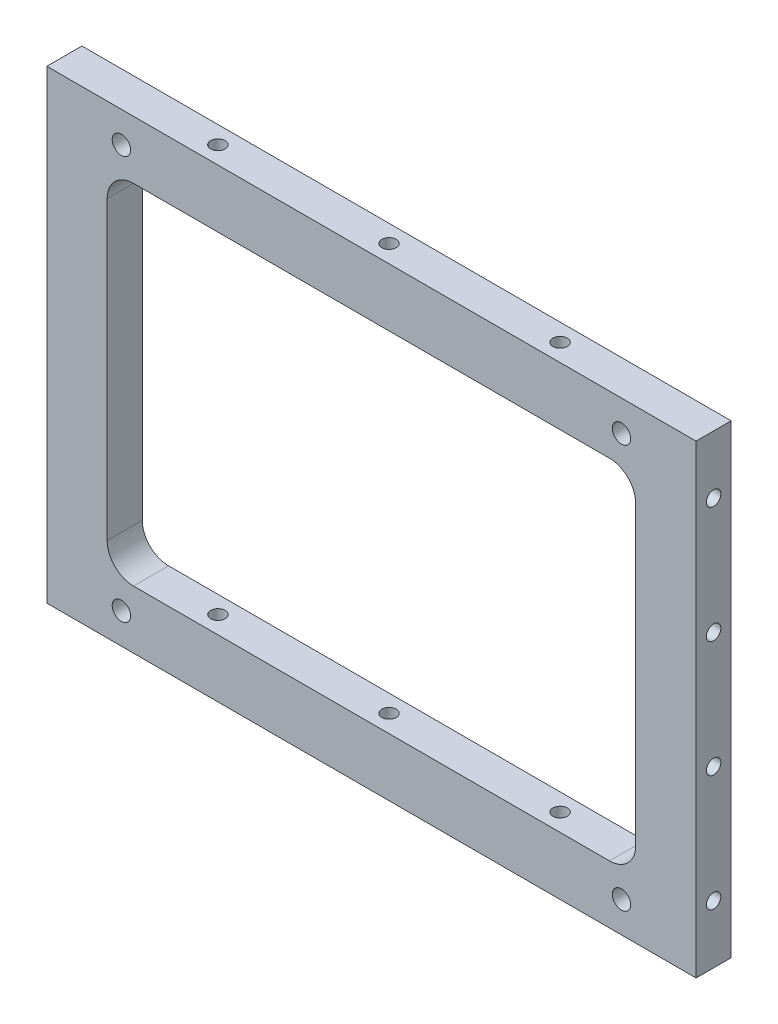
ISO-10303-21;
HEADER;
FILE_DESCRIPTION(('STEP AP214'),'2;1');
FILE_NAME('part.step','',(''),(''),'','','');
FILE_SCHEMA(('AUTOMOTIVE_DESIGN { 1 0 10303 214 1 1 1 1 }'));
ENDSEC;
DATA;
#1=APPLICATION_CONTEXT('core data for automotive mechanical design processes');
#2=APPLICATION_PROTOCOL_DEFINITION('international standard','automotive_design',2000,#1);
#3=PRODUCT_CONTEXT('',#1,'mechanical');
#4=PRODUCT('Part','Part','',(#3));
#5=PRODUCT_RELATED_PRODUCT_CATEGORY('part','',(#4));
#6=PRODUCT_DEFINITION_FORMATION('','',#4);
#7=PRODUCT_DEFINITION_CONTEXT('part definition',#1,'design');
#8=PRODUCT_DEFINITION('design','',#6,#7);
#9=PRODUCT_DEFINITION_SHAPE('','',#8);
#10=(LENGTH_UNIT() NAMED_UNIT(*) SI_UNIT(.MILLI.,.METRE.));
#11=(NAMED_UNIT(*) PLANE_ANGLE_UNIT() SI_UNIT($,.RADIAN.));
#12=(NAMED_UNIT(*) SI_UNIT($,.STERADIAN.) SOLID_ANGLE_UNIT());
#13=UNCERTAINTY_MEASURE_WITH_UNIT(LENGTH_MEASURE(1.E-05),#10,'distance_accuracy_value','');
#14=(GEOMETRIC_REPRESENTATION_CONTEXT(3) GLOBAL_UNCERTAINTY_ASSIGNED_CONTEXT((#13)) GLOBAL_UNIT_ASSIGNED_CONTEXT((#10,
#11,#12)) REPRESENTATION_CONTEXT('',''));
#15=CARTESIAN_POINT('',(0.,0.,0.));
#16=DIRECTION('',(0.,0.,1.));
#17=DIRECTION('',(1.,0.,0.));
#18=AXIS2_PLACEMENT_3D('',#15,#16,#17);
#19=CARTESIAN_POINT('',(74.,53.,-8.));
#20=DIRECTION('',(1.,0.,0.));
#21=DIRECTION('',(0.,0.,-1.));
#22=AXIS2_PLACEMENT_3D('',#19,#20,#21);
#23=PLANE('',#22);
#24=CARTESIAN_POINT('',(74.,-13.25,-4.00000000000033));
#25=DIRECTION('',(1.,0.,0.));
#26=DIRECTION('',(0.,0.,-1.));
#27=AXIS2_PLACEMENT_3D('',#24,#25,#26);
#28=CIRCLE('',#27,1.65);
#29=CARTESIAN_POINT('',(74.,-13.25,-5.65000000000032));
#30=VERTEX_POINT('',#29);
#31=EDGE_CURVE('E307',#30,#30,#28,.F.);
#32=ORIENTED_EDGE('',*,*,#31,.T.);
#33=EDGE_LOOP('',(#32));
#34=FACE_BOUND('',#33,.T.);
#35=CARTESIAN_POINT('',(74.,-39.75,-4.00000000000014));
#36=DIRECTION('',(1.,0.,0.));
#37=DIRECTION('',(0.,0.,-1.));
#38=AXIS2_PLACEMENT_3D('',#35,#36,#37);
#39=CIRCLE('',#38,1.65);
#40=CARTESIAN_POINT('',(74.,-39.75,-5.65000000000014));
#41=VERTEX_POINT('',#40);
#42=EDGE_CURVE('E311',#41,#41,#39,.F.);
#43=ORIENTED_EDGE('',*,*,#42,.T.);
#44=EDGE_LOOP('',(#43));
#45=FACE_BOUND('',#44,.T.);
#46=DIRECTION('',(0.,1.,0.));
#47=VECTOR('',#46,1.);
#48=CARTESIAN_POINT('',(74.,53.,0.));
#49=LINE('',#48,#47);
#50=CARTESIAN_POINT('',(74.,-53.,0.));
#51=VERTEX_POINT('',#50);
#52=CARTESIAN_POINT('',(74.,53.,0.));
#53=VERTEX_POINT('',#52);
#54=EDGE_CURVE('E131',#51,#53,#49,.T.);
#55=ORIENTED_EDGE('',*,*,#54,.F.);
#56=DIRECTION('',(0.,0.,1.));
#57=VECTOR('',#56,1.);
#58=CARTESIAN_POINT('',(74.,-53.,-8.));
#59=LINE('',#58,#57);
#60=CARTESIAN_POINT('',(74.,-53.,-8.));
#61=VERTEX_POINT('',#60);
#62=EDGE_CURVE('E11',#61,#51,#59,.T.);
#63=ORIENTED_EDGE('',*,*,#62,.F.);
#64=DIRECTION('',(0.,1.,0.));
#65=VECTOR('',#64,1.);
#66=CARTESIAN_POINT('',(74.,53.,-8.));
#67=LINE('',#66,#65);
#68=CARTESIAN_POINT('',(74.,53.,-8.));
#69=VERTEX_POINT('',#68);
#70=EDGE_CURVE('E180',#61,#69,#67,.T.);
#71=ORIENTED_EDGE('',*,*,#70,.T.);
#72=DIRECTION('',(0.,0.,1.));
#73=VECTOR('',#72,1.);
#74=CARTESIAN_POINT('',(74.,53.,-8.));
#75=LINE('',#74,#73);
#76=EDGE_CURVE('E193',#69,#53,#75,.T.);
#77=ORIENTED_EDGE('',*,*,#76,.T.);
#78=EDGE_LOOP('',(#55,#63,#71,#77));
#79=FACE_BOUND('',#78,.T.);
#80=CARTESIAN_POINT('',(74.,13.25,-4.00000000000028));
#81=DIRECTION('',(1.,0.,0.));
#82=DIRECTION('',(0.,0.,-1.));
#83=AXIS2_PLACEMENT_3D('',#80,#81,#82);
#84=CIRCLE('',#83,1.65);
#85=CARTESIAN_POINT('',(74.,13.25,-5.65000000000028));
#86=VERTEX_POINT('',#85);
#87=EDGE_CURVE('E317',#86,#86,#84,.T.);
#88=ORIENTED_EDGE('',*,*,#87,.F.);
#89=EDGE_LOOP('',(#88));
#90=FACE_BOUND('',#89,.T.);
#91=CARTESIAN_POINT('',(74.,39.75,-4.));
#92=DIRECTION('',(1.,0.,0.));
#93=DIRECTION('',(0.,0.,-1.));
#94=AXIS2_PLACEMENT_3D('',#91,#92,#93);
#95=CIRCLE('',#94,1.65);
#96=CARTESIAN_POINT('',(74.,39.75,-5.65));
#97=VERTEX_POINT('',#96);
#98=EDGE_CURVE('E320',#97,#97,#95,.T.);
#99=ORIENTED_EDGE('',*,*,#98,.F.);
#100=EDGE_LOOP('',(#99));
#101=FACE_BOUND('',#100,.T.);
#102=ADVANCED_FACE('F36',(#34,#45,#79,#90,#101),#23,.T.);
#103=CARTESIAN_POINT('',(0.,0.,-8.));
#104=DIRECTION('',(0.,0.,1.));
#105=DIRECTION('',(1.,0.,0.));
#106=AXIS2_PLACEMENT_3D('',#103,#104,#105);
#107=PLANE('',#106);
#108=CARTESIAN_POINT('',(57.,-46.,-8.));
#109=DIRECTION('',(0.,0.,1.));
#110=DIRECTION('',(1.,0.,0.));
#111=AXIS2_PLACEMENT_3D('',#108,#109,#110);
#112=CIRCLE('',#111,2.1);
#113=CARTESIAN_POINT('',(59.1,-46.,-8.));
#114=VERTEX_POINT('',#113);
#115=EDGE_CURVE('E248',#114,#114,#112,.F.);
#116=ORIENTED_EDGE('',*,*,#115,.F.);
#117=EDGE_LOOP('',(#116));
#118=FACE_BOUND('',#117,.T.);
#119=CARTESIAN_POINT('',(-57.,-46.,-8.));
#120=DIRECTION('',(0.,0.,1.));
#121=DIRECTION('',(1.,0.,0.));
#122=AXIS2_PLACEMENT_3D('',#119,#120,#121);
#123=CIRCLE('',#122,2.1);
#124=CARTESIAN_POINT('',(-54.9,-46.,-8.));
#125=VERTEX_POINT('',#124);
#126=EDGE_CURVE('E242',#125,#125,#123,.F.);
#127=ORIENTED_EDGE('',*,*,#126,.F.);
#128=EDGE_LOOP('',(#127));
#129=FACE_BOUND('',#128,.T.);
#130=CARTESIAN_POINT('',(-57.,46.,-8.));
#131=DIRECTION('',(0.,0.,1.));
#132=DIRECTION('',(1.,0.,0.));
#133=AXIS2_PLACEMENT_3D('',#130,#131,#132);
#134=CIRCLE('',#133,2.1);
#135=CARTESIAN_POINT('',(-54.9,46.,-8.));
#136=VERTEX_POINT('',#135);
#137=EDGE_CURVE('E235',#136,#136,#134,.F.);
#138=ORIENTED_EDGE('',*,*,#137,.F.);
#139=EDGE_LOOP('',(#138));
#140=FACE_BOUND('',#139,.T.);
#141=CARTESIAN_POINT('',(57.,46.,-8.));
#142=DIRECTION('',(0.,0.,1.));
#143=DIRECTION('',(1.,0.,0.));
#144=AXIS2_PLACEMENT_3D('',#141,#142,#143);
#145=CIRCLE('',#144,2.1);
#146=CARTESIAN_POINT('',(59.1,46.,-8.));
#147=VERTEX_POINT('',#146);
#148=EDGE_CURVE('E234',#147,#147,#145,.F.);
#149=ORIENTED_EDGE('',*,*,#148,.F.);
#150=EDGE_LOOP('',(#149));
#151=FACE_BOUND('',#150,.T.);
#152=ORIENTED_EDGE('',*,*,#70,.F.);
#153=DIRECTION('',(1.,0.,0.));
#154=VECTOR('',#153,1.);
#155=CARTESIAN_POINT('',(-74.,-53.,-8.));
#156=LINE('',#155,#154);
#157=CARTESIAN_POINT('',(-74.,-53.,-8.));
#158=VERTEX_POINT('',#157);
#159=EDGE_CURVE('E190',#158,#61,#156,.T.);
#160=ORIENTED_EDGE('',*,*,#159,.F.);
#161=DIRECTION('',(0.,-1.,0.));
#162=VECTOR('',#161,1.);
#163=CARTESIAN_POINT('',(-74.,53.,-8.));
#164=LINE('',#163,#162);
#165=CARTESIAN_POINT('',(-74.,53.,-8.));
#166=VERTEX_POINT('',#165);
#167=EDGE_CURVE('E187',#166,#158,#164,.T.);
#168=ORIENTED_EDGE('',*,*,#167,.F.);
#169=DIRECTION('',(-1.,0.,0.));
#170=VECTOR('',#169,1.);
#171=CARTESIAN_POINT('',(-74.,53.,-8.));
#172=LINE('',#171,#170);
#173=EDGE_CURVE('E183',#69,#166,#172,.T.);
#174=ORIENTED_EDGE('',*,*,#173,.F.);
#175=EDGE_LOOP('',(#152,#160,#168,#174));
#176=FACE_BOUND('',#175,.T.);
#177=CARTESIAN_POINT('',(54.25,33.75,-8.));
#178=DIRECTION('',(0.,0.,1.));
#179=DIRECTION('',(1.,0.,0.));
#180=AXIS2_PLACEMENT_3D('',#177,#178,#179);
#181=CIRCLE('',#180,6.00000000000001);
#182=CARTESIAN_POINT('',(60.25,33.75,-8.));
#183=VERTEX_POINT('',#182);
#184=CARTESIAN_POINT('',(54.25,39.75,-8.));
#185=VERTEX_POINT('',#184);
#186=EDGE_CURVE('E135',#183,#185,#181,.T.);
#187=ORIENTED_EDGE('',*,*,#186,.T.);
#188=DIRECTION('',(-1.,0.,0.));
#189=VECTOR('',#188,1.);
#190=CARTESIAN_POINT('',(0.,39.75,-8.));
#191=LINE('',#190,#189);
#192=CARTESIAN_POINT('',(-54.25,39.75,-8.));
#193=VERTEX_POINT('',#192);
#194=EDGE_CURVE('E124',#185,#193,#191,.T.);
#195=ORIENTED_EDGE('',*,*,#194,.T.);
#196=CARTESIAN_POINT('',(-54.25,33.75,-8.));
#197=DIRECTION('',(0.,0.,1.));
#198=DIRECTION('',(1.,0.,0.));
#199=AXIS2_PLACEMENT_3D('',#196,#197,#198);
#200=CIRCLE('',#199,5.99999999999999);
#201=CARTESIAN_POINT('',(-60.25,33.75,-8.));
#202=VERTEX_POINT('',#201);
#203=EDGE_CURVE('E238',#202,#193,#200,.F.);
#204=ORIENTED_EDGE('',*,*,#203,.F.);
#205=DIRECTION('',(0.,1.,0.));
#206=VECTOR('',#205,1.);
#207=CARTESIAN_POINT('',(-60.25,0.,-8.));
#208=LINE('',#207,#206);
#209=CARTESIAN_POINT('',(-60.25,-33.75,-8.));
#210=VERTEX_POINT('',#209);
#211=EDGE_CURVE('E256',#210,#202,#208,.T.);
#212=ORIENTED_EDGE('',*,*,#211,.F.);
#213=CARTESIAN_POINT('',(-54.25,-33.75,-8.));
#214=DIRECTION('',(0.,0.,1.));
#215=DIRECTION('',(1.,0.,0.));
#216=AXIS2_PLACEMENT_3D('',#213,#214,#215);
#217=CIRCLE('',#216,5.99999999999999);
#218=CARTESIAN_POINT('',(-54.25,-39.75,-8.));
#219=VERTEX_POINT('',#218);
#220=EDGE_CURVE('E258',#219,#210,#217,.F.);
#221=ORIENTED_EDGE('',*,*,#220,.F.);
#222=DIRECTION('',(-1.,0.,0.));
#223=VECTOR('',#222,1.);
#224=CARTESIAN_POINT('',(0.,-39.75,-8.));
#225=LINE('',#224,#223);
#226=CARTESIAN_POINT('',(54.25,-39.75,-8.));
#227=VERTEX_POINT('',#226);
#228=EDGE_CURVE('E260',#227,#219,#225,.T.);
#229=ORIENTED_EDGE('',*,*,#228,.F.);
#230=CARTESIAN_POINT('',(54.25,-33.75,-8.));
#231=DIRECTION('',(0.,0.,1.));
#232=DIRECTION('',(1.,0.,0.));
#233=AXIS2_PLACEMENT_3D('',#230,#231,#232);
#234=CIRCLE('',#233,5.99999999999999);
#235=CARTESIAN_POINT('',(60.25,-33.75,-8.));
#236=VERTEX_POINT('',#235);
#237=EDGE_CURVE('E146',#236,#227,#234,.F.);
#238=ORIENTED_EDGE('',*,*,#237,.F.);
#239=DIRECTION('',(0.,1.,0.));
#240=VECTOR('',#239,1.);
#241=CARTESIAN_POINT('',(60.25,0.,-8.));
#242=LINE('',#241,#240);
#243=EDGE_CURVE('E142',#236,#183,#242,.T.);
#244=ORIENTED_EDGE('',*,*,#243,.T.);
#245=EDGE_LOOP('',(#187,#195,#204,#212,#221,#229,#238,#244));
#246=FACE_BOUND('',#245,.T.);
#247=ADVANCED_FACE('F140',(#118,#129,#140,#151,#176,#246),#107,.F.);
#248=CARTESIAN_POINT('',(0.,0.,0.));
#249=DIRECTION('',(0.,0.,1.));
#250=DIRECTION('',(1.,0.,0.));
#251=AXIS2_PLACEMENT_3D('',#248,#249,#250);
#252=PLANE('',#251);
#253=CARTESIAN_POINT('',(57.,-46.,0.));
#254=DIRECTION('',(0.,0.,1.));
#255=DIRECTION('',(1.,0.,0.));
#256=AXIS2_PLACEMENT_3D('',#253,#254,#255);
#257=CIRCLE('',#256,2.1);
#258=CARTESIAN_POINT('',(59.1,-46.,0.));
#259=VERTEX_POINT('',#258);
#260=EDGE_CURVE('E230',#259,#259,#257,.T.);
#261=ORIENTED_EDGE('',*,*,#260,.F.);
#262=EDGE_LOOP('',(#261));
#263=FACE_BOUND('',#262,.T.);
#264=CARTESIAN_POINT('',(-57.,-46.,0.));
#265=DIRECTION('',(0.,0.,1.));
#266=DIRECTION('',(1.,0.,0.));
#267=AXIS2_PLACEMENT_3D('',#264,#265,#266);
#268=CIRCLE('',#267,2.1);
#269=CARTESIAN_POINT('',(-54.9,-46.,0.));
#270=VERTEX_POINT('',#269);
#271=EDGE_CURVE('E245',#270,#270,#268,.T.);
#272=ORIENTED_EDGE('',*,*,#271,.F.);
#273=EDGE_LOOP('',(#272));
#274=FACE_BOUND('',#273,.T.);
#275=CARTESIAN_POINT('',(-57.,46.,0.));
#276=DIRECTION('',(0.,0.,1.));
#277=DIRECTION('',(1.,0.,0.));
#278=AXIS2_PLACEMENT_3D('',#275,#276,#277);
#279=CIRCLE('',#278,2.1);
#280=CARTESIAN_POINT('',(-54.9,46.,0.));
#281=VERTEX_POINT('',#280);
#282=EDGE_CURVE('E239',#281,#281,#279,.T.);
#283=ORIENTED_EDGE('',*,*,#282,.F.);
#284=EDGE_LOOP('',(#283));
#285=FACE_BOUND('',#284,.T.);
#286=CARTESIAN_POINT('',(57.,46.,0.));
#287=DIRECTION('',(0.,0.,1.));
#288=DIRECTION('',(1.,0.,0.));
#289=AXIS2_PLACEMENT_3D('',#286,#287,#288);
#290=CIRCLE('',#289,2.1);
#291=CARTESIAN_POINT('',(59.1,46.,0.));
#292=VERTEX_POINT('',#291);
#293=EDGE_CURVE('E231',#292,#292,#290,.T.);
#294=ORIENTED_EDGE('',*,*,#293,.F.);
#295=EDGE_LOOP('',(#294));
#296=FACE_BOUND('',#295,.T.);
#297=ORIENTED_EDGE('',*,*,#54,.T.);
#298=DIRECTION('',(-1.,0.,0.));
#299=VECTOR('',#298,1.);
#300=CARTESIAN_POINT('',(-74.,53.,0.));
#301=LINE('',#300,#299);
#302=CARTESIAN_POINT('',(-74.,53.,0.));
#303=VERTEX_POINT('',#302);
#304=EDGE_CURVE('E196',#53,#303,#301,.T.);
#305=ORIENTED_EDGE('',*,*,#304,.T.);
#306=DIRECTION('',(0.,-1.,0.));
#307=VECTOR('',#306,1.);
#308=CARTESIAN_POINT('',(-74.,53.,0.));
#309=LINE('',#308,#307);
#310=CARTESIAN_POINT('',(-74.,-53.,0.));
#311=VERTEX_POINT('',#310);
#312=EDGE_CURVE('E199',#303,#311,#309,.T.);
#313=ORIENTED_EDGE('',*,*,#312,.T.);
#314=DIRECTION('',(1.,0.,0.));
#315=VECTOR('',#314,1.);
#316=CARTESIAN_POINT('',(-74.,-53.,0.));
#317=LINE('',#316,#315);
#318=EDGE_CURVE('E184',#311,#51,#317,.T.);
#319=ORIENTED_EDGE('',*,*,#318,.T.);
#320=EDGE_LOOP('',(#297,#305,#313,#319));
#321=FACE_BOUND('',#320,.T.);
#322=DIRECTION('',(1.,0.,0.));
#323=VECTOR('',#322,1.);
#324=CARTESIAN_POINT('',(0.,39.75,0.));
#325=LINE('',#324,#323);
#326=CARTESIAN_POINT('',(-54.25,39.75,0.));
#327=VERTEX_POINT('',#326);
#328=CARTESIAN_POINT('',(54.25,39.75,0.));
#329=VERTEX_POINT('',#328);
#330=EDGE_CURVE('E144',#327,#329,#325,.T.);
#331=ORIENTED_EDGE('',*,*,#330,.T.);
#332=CARTESIAN_POINT('',(54.25,33.75,0.));
#333=DIRECTION('',(0.,0.,1.));
#334=DIRECTION('',(1.,0.,0.));
#335=AXIS2_PLACEMENT_3D('',#332,#333,#334);
#336=CIRCLE('',#335,6.00000000000001);
#337=CARTESIAN_POINT('',(60.25,33.75,0.));
#338=VERTEX_POINT('',#337);
#339=EDGE_CURVE('E60',#329,#338,#336,.F.);
#340=ORIENTED_EDGE('',*,*,#339,.T.);
#341=DIRECTION('',(0.,-1.,0.));
#342=VECTOR('',#341,1.);
#343=CARTESIAN_POINT('',(60.25,0.,0.));
#344=LINE('',#343,#342);
#345=CARTESIAN_POINT('',(60.25,-33.75,0.));
#346=VERTEX_POINT('',#345);
#347=EDGE_CURVE('E137',#338,#346,#344,.T.);
#348=ORIENTED_EDGE('',*,*,#347,.T.);
#349=CARTESIAN_POINT('',(54.25,-33.75,0.));
#350=DIRECTION('',(0.,0.,1.));
#351=DIRECTION('',(1.,0.,0.));
#352=AXIS2_PLACEMENT_3D('',#349,#350,#351);
#353=CIRCLE('',#352,5.99999999999999);
#354=CARTESIAN_POINT('',(54.25,-39.75,0.));
#355=VERTEX_POINT('',#354);
#356=EDGE_CURVE('E163',#355,#346,#353,.T.);
#357=ORIENTED_EDGE('',*,*,#356,.F.);
#358=DIRECTION('',(1.,0.,0.));
#359=VECTOR('',#358,1.);
#360=CARTESIAN_POINT('',(0.,-39.75,0.));
#361=LINE('',#360,#359);
#362=CARTESIAN_POINT('',(-54.25,-39.75,0.));
#363=VERTEX_POINT('',#362);
#364=EDGE_CURVE('E160',#363,#355,#361,.T.);
#365=ORIENTED_EDGE('',*,*,#364,.F.);
#366=CARTESIAN_POINT('',(-54.25,-33.75,0.));
#367=DIRECTION('',(0.,0.,1.));
#368=DIRECTION('',(1.,0.,0.));
#369=AXIS2_PLACEMENT_3D('',#366,#367,#368);
#370=CIRCLE('',#369,5.99999999999999);
#371=CARTESIAN_POINT('',(-60.25,-33.75,0.));
#372=VERTEX_POINT('',#371);
#373=EDGE_CURVE('E157',#372,#363,#370,.T.);
#374=ORIENTED_EDGE('',*,*,#373,.F.);
#375=DIRECTION('',(0.,-1.,0.));
#376=VECTOR('',#375,1.);
#377=CARTESIAN_POINT('',(-60.25,0.,0.));
#378=LINE('',#377,#376);
#379=CARTESIAN_POINT('',(-60.25,33.75,0.));
#380=VERTEX_POINT('',#379);
#381=EDGE_CURVE('E154',#380,#372,#378,.T.);
#382=ORIENTED_EDGE('',*,*,#381,.F.);
#383=CARTESIAN_POINT('',(-54.25,33.75,0.));
#384=DIRECTION('',(0.,0.,1.));
#385=DIRECTION('',(1.,0.,0.));
#386=AXIS2_PLACEMENT_3D('',#383,#384,#385);
#387=CIRCLE('',#386,5.99999999999999);
#388=EDGE_CURVE('E151',#327,#380,#387,.T.);
#389=ORIENTED_EDGE('',*,*,#388,.F.);
#390=EDGE_LOOP('',(#331,#340,#348,#357,#365,#374,#382,#389));
#391=FACE_BOUND('',#390,.T.);
#392=ADVANCED_FACE('F283',(#263,#274,#285,#296,#321,#391),#252,.T.);
#393=CARTESIAN_POINT('',(-74.,-53.,-8.));
#394=DIRECTION('',(0.,-1.,0.));
#395=DIRECTION('',(0.,0.,-1.));
#396=AXIS2_PLACEMENT_3D('',#393,#394,#395);
#397=PLANE('',#396);
#398=CARTESIAN_POINT('',(-39.,-53.,-4.00000000000002));
#399=DIRECTION('',(0.,-1.,0.));
#400=DIRECTION('',(0.,0.,-1.));
#401=AXIS2_PLACEMENT_3D('',#398,#399,#400);
#402=CIRCLE('',#401,1.65);
#403=CARTESIAN_POINT('',(-39.,-53.,-5.65000000000002));
#404=VERTEX_POINT('',#403);
#405=EDGE_CURVE('E343',#404,#404,#402,.T.);
#406=ORIENTED_EDGE('',*,*,#405,.F.);
#407=EDGE_LOOP('',(#406));
#408=FACE_BOUND('',#407,.T.);
#409=CARTESIAN_POINT('',(0.,-53.,-4.00000000000002));
#410=DIRECTION('',(0.,-1.,0.));
#411=DIRECTION('',(0.,0.,-1.));
#412=AXIS2_PLACEMENT_3D('',#409,#410,#411);
#413=CIRCLE('',#412,1.65);
#414=CARTESIAN_POINT('',(0.,-53.,-5.65000000000002));
#415=VERTEX_POINT('',#414);
#416=EDGE_CURVE('E346',#415,#415,#413,.T.);
#417=ORIENTED_EDGE('',*,*,#416,.F.);
#418=EDGE_LOOP('',(#417));
#419=FACE_BOUND('',#418,.T.);
#420=CARTESIAN_POINT('',(39.,-53.,-4.00000000000002));
#421=DIRECTION('',(0.,-1.,0.));
#422=DIRECTION('',(0.,0.,-1.));
#423=AXIS2_PLACEMENT_3D('',#420,#421,#422);
#424=CIRCLE('',#423,1.65);
#425=CARTESIAN_POINT('',(39.,-53.,-5.65000000000002));
#426=VERTEX_POINT('',#425);
#427=EDGE_CURVE('E351',#426,#426,#424,.T.);
#428=ORIENTED_EDGE('',*,*,#427,.F.);
#429=EDGE_LOOP('',(#428));
#430=FACE_BOUND('',#429,.T.);
#431=ORIENTED_EDGE('',*,*,#318,.F.);
#432=DIRECTION('',(0.,0.,1.));
#433=VECTOR('',#432,1.);
#434=CARTESIAN_POINT('',(-74.,-53.,-8.));
#435=LINE('',#434,#433);
#436=EDGE_CURVE('E44',#158,#311,#435,.T.);
#437=ORIENTED_EDGE('',*,*,#436,.F.);
#438=ORIENTED_EDGE('',*,*,#159,.T.);
#439=ORIENTED_EDGE('',*,*,#62,.T.);
#440=EDGE_LOOP('',(#431,#437,#438,#439));
#441=FACE_BOUND('',#440,.T.);
#442=ADVANCED_FACE('F426',(#408,#419,#430,#441),#397,.T.);
#443=CARTESIAN_POINT('',(-74.,53.,-8.));
#444=DIRECTION('',(-1.,0.,0.));
#445=DIRECTION('',(0.,0.,1.));
#446=AXIS2_PLACEMENT_3D('',#443,#444,#445);
#447=PLANE('',#446);
#448=CARTESIAN_POINT('',(-74.,39.75,-4.));
#449=DIRECTION('',(-1.,0.,0.));
#450=DIRECTION('',(0.,0.,1.));
#451=AXIS2_PLACEMENT_3D('',#448,#449,#450);
#452=CIRCLE('',#451,1.65);
#453=CARTESIAN_POINT('',(-74.,39.75,-2.35));
#454=VERTEX_POINT('',#453);
#455=EDGE_CURVE('E816',#454,#454,#452,.T.);
#456=ORIENTED_EDGE('',*,*,#455,.F.);
#457=EDGE_LOOP('',(#456));
#458=FACE_BOUND('',#457,.T.);
#459=CARTESIAN_POINT('',(-74.,13.25,-3.99999999999973));
#460=DIRECTION('',(-1.,0.,0.));
#461=DIRECTION('',(0.,0.,1.));
#462=AXIS2_PLACEMENT_3D('',#459,#460,#461);
#463=CIRCLE('',#462,1.65);
#464=CARTESIAN_POINT('',(-74.,13.25,-2.34999999999973));
#465=VERTEX_POINT('',#464);
#466=EDGE_CURVE('E819',#465,#465,#463,.T.);
#467=ORIENTED_EDGE('',*,*,#466,.F.);
#468=EDGE_LOOP('',(#467));
#469=FACE_BOUND('',#468,.T.);
#470=CARTESIAN_POINT('',(-74.,-13.25,-3.99999999999968));
#471=DIRECTION('',(-1.,0.,0.));
#472=DIRECTION('',(0.,0.,-1.));
#473=AXIS2_PLACEMENT_3D('',#470,#471,#472);
#474=CIRCLE('',#473,1.65);
#475=CARTESIAN_POINT('',(-74.,-13.25,-5.64999999999969));
#476=VERTEX_POINT('',#475);
#477=EDGE_CURVE('E827',#476,#476,#474,.T.);
#478=ORIENTED_EDGE('',*,*,#477,.F.);
#479=EDGE_LOOP('',(#478));
#480=FACE_BOUND('',#479,.T.);
#481=CARTESIAN_POINT('',(-74.,-39.75,-3.99999999999986));
#482=DIRECTION('',(-1.,0.,0.));
#483=DIRECTION('',(0.,0.,-1.));
#484=AXIS2_PLACEMENT_3D('',#481,#482,#483);
#485=CIRCLE('',#484,1.65);
#486=CARTESIAN_POINT('',(-74.,-39.75,-5.64999999999986));
#487=VERTEX_POINT('',#486);
#488=EDGE_CURVE('E833',#487,#487,#485,.T.);
#489=ORIENTED_EDGE('',*,*,#488,.F.);
#490=EDGE_LOOP('',(#489));
#491=FACE_BOUND('',#490,.T.);
#492=ORIENTED_EDGE('',*,*,#312,.F.);
#493=DIRECTION('',(0.,0.,1.));
#494=VECTOR('',#493,1.);
#495=CARTESIAN_POINT('',(-74.,53.,-8.));
#496=LINE('',#495,#494);
#497=EDGE_CURVE('E205',#166,#303,#496,.T.);
#498=ORIENTED_EDGE('',*,*,#497,.F.);
#499=ORIENTED_EDGE('',*,*,#167,.T.);
#500=ORIENTED_EDGE('',*,*,#436,.T.);
#501=EDGE_LOOP('',(#492,#498,#499,#500));
#502=FACE_BOUND('',#501,.T.);
#503=ADVANCED_FACE('F430',(#458,#469,#480,#491,#502),#447,.T.);
#504=CARTESIAN_POINT('',(-74.,53.,-8.));
#505=DIRECTION('',(0.,1.,0.));
#506=DIRECTION('',(0.,0.,1.));
#507=AXIS2_PLACEMENT_3D('',#504,#505,#506);
#508=PLANE('',#507);
#509=CARTESIAN_POINT('',(-39.,53.,-4.00000000000002));
#510=DIRECTION('',(0.,-1.,0.));
#511=DIRECTION('',(0.,0.,-1.));
#512=AXIS2_PLACEMENT_3D('',#509,#510,#511);
#513=CIRCLE('',#512,1.65);
#514=CARTESIAN_POINT('',(-39.,53.,-5.65000000000002));
#515=VERTEX_POINT('',#514);
#516=EDGE_CURVE('E211',#515,#515,#513,.T.);
#517=ORIENTED_EDGE('',*,*,#516,.T.);
#518=EDGE_LOOP('',(#517));
#519=FACE_BOUND('',#518,.T.);
#520=CARTESIAN_POINT('',(0.,53.,-4.00000000000002));
#521=DIRECTION('',(0.,-1.,0.));
#522=DIRECTION('',(0.,0.,-1.));
#523=AXIS2_PLACEMENT_3D('',#520,#521,#522);
#524=CIRCLE('',#523,1.65);
#525=CARTESIAN_POINT('',(0.,53.,-5.65000000000002));
#526=VERTEX_POINT('',#525);
#527=EDGE_CURVE('E349',#526,#526,#524,.T.);
#528=ORIENTED_EDGE('',*,*,#527,.T.);
#529=EDGE_LOOP('',(#528));
#530=FACE_BOUND('',#529,.T.);
#531=CARTESIAN_POINT('',(39.,53.,-4.00000000000002));
#532=DIRECTION('',(0.,-1.,0.));
#533=DIRECTION('',(0.,0.,-1.));
#534=AXIS2_PLACEMENT_3D('',#531,#532,#533);
#535=CIRCLE('',#534,1.65);
#536=CARTESIAN_POINT('',(39.,53.,-5.65000000000002));
#537=VERTEX_POINT('',#536);
#538=EDGE_CURVE('E224',#537,#537,#535,.T.);
#539=ORIENTED_EDGE('',*,*,#538,.T.);
#540=EDGE_LOOP('',(#539));
#541=FACE_BOUND('',#540,.T.);
#542=ORIENTED_EDGE('',*,*,#304,.F.);
#543=ORIENTED_EDGE('',*,*,#76,.F.);
#544=ORIENTED_EDGE('',*,*,#173,.T.);
#545=ORIENTED_EDGE('',*,*,#497,.T.);
#546=EDGE_LOOP('',(#542,#543,#544,#545));
#547=FACE_BOUND('',#546,.T.);
#548=ADVANCED_FACE('F294',(#519,#530,#541,#547),#508,.T.);
#549=CARTESIAN_POINT('',(54.25,33.75,-8.001));
#550=DIRECTION('',(0.,0.,1.));
#551=DIRECTION('',(1.,0.,0.));
#552=AXIS2_PLACEMENT_3D('',#549,#550,#551);
#553=CYLINDRICAL_SURFACE('',#552,6.00000000000001);
#554=DIRECTION('',(0.,0.,1.));
#555=VECTOR('',#554,1.);
#556=CARTESIAN_POINT('',(60.25,33.75,-8.001));
#557=LINE('',#556,#555);
#558=EDGE_CURVE('E132',#183,#338,#557,.T.);
#559=ORIENTED_EDGE('',*,*,#558,.T.);
#560=ORIENTED_EDGE('',*,*,#339,.F.);
#561=DIRECTION('',(0.,0.,1.));
#562=VECTOR('',#561,1.);
#563=CARTESIAN_POINT('',(54.25,39.75,-8.001));
#564=LINE('',#563,#562);
#565=EDGE_CURVE('E126',#185,#329,#564,.T.);
#566=ORIENTED_EDGE('',*,*,#565,.F.);
#567=ORIENTED_EDGE('',*,*,#186,.F.);
#568=EDGE_LOOP('',(#559,#560,#566,#567));
#569=FACE_BOUND('',#568,.T.);
#570=ADVANCED_FACE('F134',(#569),#553,.F.);
#571=CARTESIAN_POINT('',(60.25,0.,-8.001));
#572=DIRECTION('',(-1.,0.,0.));
#573=DIRECTION('',(0.,-1.,0.));
#574=AXIS2_PLACEMENT_3D('',#571,#572,#573);
#575=PLANE('',#574);
#576=DIRECTION('',(0.,0.,1.));
#577=VECTOR('',#576,1.);
#578=CARTESIAN_POINT('',(60.25,-33.75,-8.001));
#579=LINE('',#578,#577);
#580=EDGE_CURVE('E169',#236,#346,#579,.T.);
#581=ORIENTED_EDGE('',*,*,#580,.T.);
#582=ORIENTED_EDGE('',*,*,#347,.F.);
#583=ORIENTED_EDGE('',*,*,#558,.F.);
#584=ORIENTED_EDGE('',*,*,#243,.F.);
#585=EDGE_LOOP('',(#581,#582,#583,#584));
#586=FACE_BOUND('',#585,.T.);
#587=ADVANCED_FACE('F286',(#586),#575,.T.);
#588=CARTESIAN_POINT('',(54.25,-33.75,-8.001));
#589=DIRECTION('',(0.,0.,1.));
#590=DIRECTION('',(1.,0.,0.));
#591=AXIS2_PLACEMENT_3D('',#588,#589,#590);
#592=CYLINDRICAL_SURFACE('',#591,5.99999999999999);
#593=ORIENTED_EDGE('',*,*,#237,.T.);
#594=DIRECTION('',(0.,0.,1.));
#595=VECTOR('',#594,1.);
#596=CARTESIAN_POINT('',(54.25,-39.75,-8.001));
#597=LINE('',#596,#595);
#598=EDGE_CURVE('E171',#227,#355,#597,.T.);
#599=ORIENTED_EDGE('',*,*,#598,.T.);
#600=ORIENTED_EDGE('',*,*,#356,.T.);
#601=ORIENTED_EDGE('',*,*,#580,.F.);
#602=EDGE_LOOP('',(#593,#599,#600,#601));
#603=FACE_BOUND('',#602,.T.);
#604=ADVANCED_FACE('F264',(#603),#592,.F.);
#605=CARTESIAN_POINT('',(0.,-39.75,-8.001));
#606=DIRECTION('',(0.,-1.,0.));
#607=DIRECTION('',(0.,0.,-1.));
#608=AXIS2_PLACEMENT_3D('',#605,#606,#607);
#609=PLANE('',#608);
#610=CARTESIAN_POINT('',(-39.,-39.75,-4.00000000000002));
#611=DIRECTION('',(0.,-1.,0.));
#612=DIRECTION('',(0.,0.,-1.));
#613=AXIS2_PLACEMENT_3D('',#610,#611,#612);
#614=CIRCLE('',#613,1.65);
#615=CARTESIAN_POINT('',(-39.,-39.75,-5.65000000000002));
#616=VERTEX_POINT('',#615);
#617=EDGE_CURVE('E227',#616,#616,#614,.T.);
#618=ORIENTED_EDGE('',*,*,#617,.T.);
#619=EDGE_LOOP('',(#618));
#620=FACE_BOUND('',#619,.T.);
#621=CARTESIAN_POINT('',(0.,-39.75,-4.00000000000002));
#622=DIRECTION('',(0.,-1.,0.));
#623=DIRECTION('',(0.,0.,-1.));
#624=AXIS2_PLACEMENT_3D('',#621,#622,#623);
#625=CIRCLE('',#624,1.65);
#626=CARTESIAN_POINT('',(0.,-39.75,-5.65000000000002));
#627=VERTEX_POINT('',#626);
#628=EDGE_CURVE('E214',#627,#627,#625,.T.);
#629=ORIENTED_EDGE('',*,*,#628,.T.);
#630=EDGE_LOOP('',(#629));
#631=FACE_BOUND('',#630,.T.);
#632=CARTESIAN_POINT('',(39.,-39.75,-4.00000000000002));
#633=DIRECTION('',(0.,-1.,0.));
#634=DIRECTION('',(0.,0.,-1.));
#635=AXIS2_PLACEMENT_3D('',#632,#633,#634);
#636=CIRCLE('',#635,1.65);
#637=CARTESIAN_POINT('',(39.,-39.75,-5.65000000000002));
#638=VERTEX_POINT('',#637);
#639=EDGE_CURVE('E210',#638,#638,#636,.T.);
#640=ORIENTED_EDGE('',*,*,#639,.T.);
#641=EDGE_LOOP('',(#640));
#642=FACE_BOUND('',#641,.T.);
#643=ORIENTED_EDGE('',*,*,#228,.T.);
#644=DIRECTION('',(0.,0.,1.));
#645=VECTOR('',#644,1.);
#646=CARTESIAN_POINT('',(-54.25,-39.75,-8.001));
#647=LINE('',#646,#645);
#648=EDGE_CURVE('E173',#219,#363,#647,.T.);
#649=ORIENTED_EDGE('',*,*,#648,.T.);
#650=ORIENTED_EDGE('',*,*,#364,.T.);
#651=ORIENTED_EDGE('',*,*,#598,.F.);
#652=EDGE_LOOP('',(#643,#649,#650,#651));
#653=FACE_BOUND('',#652,.T.);
#654=ADVANCED_FACE('F267',(#620,#631,#642,#653),#609,.F.);
#655=CARTESIAN_POINT('',(-54.25,-33.75,-8.001));
#656=DIRECTION('',(0.,0.,1.));
#657=DIRECTION('',(1.,0.,0.));
#658=AXIS2_PLACEMENT_3D('',#655,#656,#657);
#659=CYLINDRICAL_SURFACE('',#658,5.99999999999999);
#660=ORIENTED_EDGE('',*,*,#220,.T.);
#661=DIRECTION('',(0.,0.,1.));
#662=VECTOR('',#661,1.);
#663=CARTESIAN_POINT('',(-60.25,-33.75,-8.001));
#664=LINE('',#663,#662);
#665=EDGE_CURVE('E175',#210,#372,#664,.T.);
#666=ORIENTED_EDGE('',*,*,#665,.T.);
#667=ORIENTED_EDGE('',*,*,#373,.T.);
#668=ORIENTED_EDGE('',*,*,#648,.F.);
#669=EDGE_LOOP('',(#660,#666,#667,#668));
#670=FACE_BOUND('',#669,.T.);
#671=ADVANCED_FACE('F275',(#670),#659,.F.);
#672=CARTESIAN_POINT('',(-60.25,0.,-8.001));
#673=DIRECTION('',(-1.,0.,0.));
#674=DIRECTION('',(0.,-1.,0.));
#675=AXIS2_PLACEMENT_3D('',#672,#673,#674);
#676=PLANE('',#675);
#677=ORIENTED_EDGE('',*,*,#211,.T.);
#678=DIRECTION('',(0.,0.,1.));
#679=VECTOR('',#678,1.);
#680=CARTESIAN_POINT('',(-60.25,33.75,-8.001));
#681=LINE('',#680,#679);
#682=EDGE_CURVE('E177',#202,#380,#681,.T.);
#683=ORIENTED_EDGE('',*,*,#682,.T.);
#684=ORIENTED_EDGE('',*,*,#381,.T.);
#685=ORIENTED_EDGE('',*,*,#665,.F.);
#686=EDGE_LOOP('',(#677,#683,#684,#685));
#687=FACE_BOUND('',#686,.T.);
#688=ADVANCED_FACE('F277',(#687),#676,.F.);
#689=CARTESIAN_POINT('',(-54.25,33.75,-8.001));
#690=DIRECTION('',(0.,0.,1.));
#691=DIRECTION('',(1.,0.,0.));
#692=AXIS2_PLACEMENT_3D('',#689,#690,#691);
#693=CYLINDRICAL_SURFACE('',#692,5.99999999999999);
#694=ORIENTED_EDGE('',*,*,#203,.T.);
#695=DIRECTION('',(0.,0.,1.));
#696=VECTOR('',#695,1.);
#697=CARTESIAN_POINT('',(-54.25,39.75,-8.001));
#698=LINE('',#697,#696);
#699=EDGE_CURVE('E52',#193,#327,#698,.T.);
#700=ORIENTED_EDGE('',*,*,#699,.T.);
#701=ORIENTED_EDGE('',*,*,#388,.T.);
#702=ORIENTED_EDGE('',*,*,#682,.F.);
#703=EDGE_LOOP('',(#694,#700,#701,#702));
#704=FACE_BOUND('',#703,.T.);
#705=ADVANCED_FACE('F416',(#704),#693,.F.);
#706=CARTESIAN_POINT('',(0.,39.75,-8.001));
#707=DIRECTION('',(0.,-1.,0.));
#708=DIRECTION('',(0.,0.,-1.));
#709=AXIS2_PLACEMENT_3D('',#706,#707,#708);
#710=PLANE('',#709);
#711=CARTESIAN_POINT('',(-39.,39.75,-4.00000000000002));
#712=DIRECTION('',(0.,-1.,0.));
#713=DIRECTION('',(0.,0.,-1.));
#714=AXIS2_PLACEMENT_3D('',#711,#712,#713);
#715=CIRCLE('',#714,1.65);
#716=CARTESIAN_POINT('',(-39.,39.75,-5.65000000000002));
#717=VERTEX_POINT('',#716);
#718=EDGE_CURVE('E39',#717,#717,#715,.T.);
#719=ORIENTED_EDGE('',*,*,#718,.F.);
#720=EDGE_LOOP('',(#719));
#721=FACE_BOUND('',#720,.T.);
#722=CARTESIAN_POINT('',(0.,39.75,-4.00000000000002));
#723=DIRECTION('',(0.,-1.,0.));
#724=DIRECTION('',(0.,0.,-1.));
#725=AXIS2_PLACEMENT_3D('',#722,#723,#724);
#726=CIRCLE('',#725,1.65);
#727=CARTESIAN_POINT('',(0.,39.75,-5.65000000000002));
#728=VERTEX_POINT('',#727);
#729=EDGE_CURVE('E212',#728,#728,#726,.T.);
#730=ORIENTED_EDGE('',*,*,#729,.F.);
#731=EDGE_LOOP('',(#730));
#732=FACE_BOUND('',#731,.T.);
#733=CARTESIAN_POINT('',(39.,39.75,-4.00000000000002));
#734=DIRECTION('',(0.,-1.,0.));
#735=DIRECTION('',(0.,0.,-1.));
#736=AXIS2_PLACEMENT_3D('',#733,#734,#735);
#737=CIRCLE('',#736,1.65);
#738=CARTESIAN_POINT('',(39.,39.75,-5.65000000000002));
#739=VERTEX_POINT('',#738);
#740=EDGE_CURVE('E208',#739,#739,#737,.T.);
#741=ORIENTED_EDGE('',*,*,#740,.F.);
#742=EDGE_LOOP('',(#741));
#743=FACE_BOUND('',#742,.T.);
#744=ORIENTED_EDGE('',*,*,#565,.T.);
#745=ORIENTED_EDGE('',*,*,#330,.F.);
#746=ORIENTED_EDGE('',*,*,#699,.F.);
#747=ORIENTED_EDGE('',*,*,#194,.F.);
#748=EDGE_LOOP('',(#744,#745,#746,#747));
#749=FACE_BOUND('',#748,.T.);
#750=ADVANCED_FACE('F125',(#721,#732,#743,#749),#710,.T.);
#751=CARTESIAN_POINT('',(57.,46.,-8.001));
#752=DIRECTION('',(0.,0.,1.));
#753=DIRECTION('',(1.,0.,0.));
#754=AXIS2_PLACEMENT_3D('',#751,#752,#753);
#755=CYLINDRICAL_SURFACE('',#754,2.1);
#756=ORIENTED_EDGE('',*,*,#293,.T.);
#757=EDGE_LOOP('',(#756));
#758=FACE_BOUND('',#757,.T.);
#759=ORIENTED_EDGE('',*,*,#148,.T.);
#760=EDGE_LOOP('',(#759));
#761=FACE_BOUND('',#760,.T.);
#762=ADVANCED_FACE('F421',(#758,#761),#755,.F.);
#763=CARTESIAN_POINT('',(-57.,46.,-8.001));
#764=DIRECTION('',(0.,0.,1.));
#765=DIRECTION('',(1.,0.,0.));
#766=AXIS2_PLACEMENT_3D('',#763,#764,#765);
#767=CYLINDRICAL_SURFACE('',#766,2.1);
#768=ORIENTED_EDGE('',*,*,#282,.T.);
#769=EDGE_LOOP('',(#768));
#770=FACE_BOUND('',#769,.T.);
#771=ORIENTED_EDGE('',*,*,#137,.T.);
#772=EDGE_LOOP('',(#771));
#773=FACE_BOUND('',#772,.T.);
#774=ADVANCED_FACE('F499',(#770,#773),#767,.F.);
#775=CARTESIAN_POINT('',(-57.,-46.,-8.001));
#776=DIRECTION('',(0.,0.,1.));
#777=DIRECTION('',(1.,0.,0.));
#778=AXIS2_PLACEMENT_3D('',#775,#776,#777);
#779=CYLINDRICAL_SURFACE('',#778,2.1);
#780=ORIENTED_EDGE('',*,*,#271,.T.);
#781=EDGE_LOOP('',(#780));
#782=FACE_BOUND('',#781,.T.);
#783=ORIENTED_EDGE('',*,*,#126,.T.);
#784=EDGE_LOOP('',(#783));
#785=FACE_BOUND('',#784,.T.);
#786=ADVANCED_FACE('F374',(#782,#785),#779,.F.);
#787=CARTESIAN_POINT('',(57.,-46.,-8.001));
#788=DIRECTION('',(0.,0.,1.));
#789=DIRECTION('',(1.,0.,0.));
#790=AXIS2_PLACEMENT_3D('',#787,#788,#789);
#791=CYLINDRICAL_SURFACE('',#790,2.1);
#792=ORIENTED_EDGE('',*,*,#260,.T.);
#793=EDGE_LOOP('',(#792));
#794=FACE_BOUND('',#793,.T.);
#795=ORIENTED_EDGE('',*,*,#115,.T.);
#796=EDGE_LOOP('',(#795));
#797=FACE_BOUND('',#796,.T.);
#798=ADVANCED_FACE('F363',(#794,#797),#791,.F.);
#799=CARTESIAN_POINT('',(39.,53.,-4.00000000000002));
#800=DIRECTION('',(0.,-1.,0.));
#801=DIRECTION('',(0.,0.,-1.));
#802=AXIS2_PLACEMENT_3D('',#799,#800,#801);
#803=CYLINDRICAL_SURFACE('',#802,1.65);
#804=ORIENTED_EDGE('',*,*,#740,.T.);
#805=EDGE_LOOP('',(#804));
#806=FACE_BOUND('',#805,.T.);
#807=ORIENTED_EDGE('',*,*,#538,.F.);
#808=EDGE_LOOP('',(#807));
#809=FACE_BOUND('',#808,.T.);
#810=ADVANCED_FACE('F360',(#806,#809),#803,.F.);
#811=CARTESIAN_POINT('',(0.,53.,-4.00000000000002));
#812=DIRECTION('',(0.,-1.,0.));
#813=DIRECTION('',(0.,0.,-1.));
#814=AXIS2_PLACEMENT_3D('',#811,#812,#813);
#815=CYLINDRICAL_SURFACE('',#814,1.65);
#816=ORIENTED_EDGE('',*,*,#729,.T.);
#817=EDGE_LOOP('',(#816));
#818=FACE_BOUND('',#817,.T.);
#819=ORIENTED_EDGE('',*,*,#527,.F.);
#820=EDGE_LOOP('',(#819));
#821=FACE_BOUND('',#820,.T.);
#822=ADVANCED_FACE('F362',(#818,#821),#815,.F.);
#823=CARTESIAN_POINT('',(-39.,53.,-4.00000000000002));
#824=DIRECTION('',(0.,-1.,0.));
#825=DIRECTION('',(0.,0.,-1.));
#826=AXIS2_PLACEMENT_3D('',#823,#824,#825);
#827=CYLINDRICAL_SURFACE('',#826,1.65);
#828=ORIENTED_EDGE('',*,*,#718,.T.);
#829=EDGE_LOOP('',(#828));
#830=FACE_BOUND('',#829,.T.);
#831=ORIENTED_EDGE('',*,*,#516,.F.);
#832=EDGE_LOOP('',(#831));
#833=FACE_BOUND('',#832,.T.);
#834=ADVANCED_FACE('F371',(#830,#833),#827,.F.);
#835=ORIENTED_EDGE('',*,*,#427,.T.);
#836=EDGE_LOOP('',(#835));
#837=FACE_BOUND('',#836,.T.);
#838=ORIENTED_EDGE('',*,*,#639,.F.);
#839=EDGE_LOOP('',(#838));
#840=FACE_BOUND('',#839,.T.);
#841=ADVANCED_FACE('F366',(#837,#840),#803,.F.);
#842=ORIENTED_EDGE('',*,*,#416,.T.);
#843=EDGE_LOOP('',(#842));
#844=FACE_BOUND('',#843,.T.);
#845=ORIENTED_EDGE('',*,*,#628,.F.);
#846=EDGE_LOOP('',(#845));
#847=FACE_BOUND('',#846,.T.);
#848=ADVANCED_FACE('F373',(#844,#847),#815,.F.);
#849=ORIENTED_EDGE('',*,*,#405,.T.);
#850=EDGE_LOOP('',(#849));
#851=FACE_BOUND('',#850,.T.);
#852=ORIENTED_EDGE('',*,*,#617,.F.);
#853=EDGE_LOOP('',(#852));
#854=FACE_BOUND('',#853,.T.);
#855=ADVANCED_FACE('F382',(#851,#854),#827,.F.);
#856=CARTESIAN_POINT('',(64.,-39.75,-4.00000000000014));
#857=DIRECTION('',(1.,0.,0.));
#858=DIRECTION('',(0.,0.,-1.));
#859=AXIS2_PLACEMENT_3D('',#856,#857,#858);
#860=CYLINDRICAL_SURFACE('',#859,1.65);
#861=CARTESIAN_POINT('',(64.,-39.75,-4.00000000000014));
#862=DIRECTION('',(1.,0.,0.));
#863=DIRECTION('',(0.,0.,-1.));
#864=AXIS2_PLACEMENT_3D('',#861,#862,#863);
#865=CIRCLE('',#864,1.65);
#866=CARTESIAN_POINT('',(64.,-39.75,-5.65000000000014));
#867=VERTEX_POINT('',#866);
#868=EDGE_CURVE('E336',#867,#867,#865,.F.);
#869=ORIENTED_EDGE('',*,*,#868,.T.);
#870=EDGE_LOOP('',(#869));
#871=FACE_BOUND('',#870,.T.);
#872=ORIENTED_EDGE('',*,*,#42,.F.);
#873=EDGE_LOOP('',(#872));
#874=FACE_BOUND('',#873,.T.);
#875=ADVANCED_FACE('F393',(#871,#874),#860,.F.);
#876=CARTESIAN_POINT('',(64.,0.,0.));
#877=DIRECTION('',(1.,0.,0.));
#878=DIRECTION('',(0.,0.,-1.));
#879=AXIS2_PLACEMENT_3D('',#876,#877,#878);
#880=PLANE('',#879);
#881=ORIENTED_EDGE('',*,*,#868,.F.);
#882=EDGE_LOOP('',(#881));
#883=FACE_BOUND('',#882,.T.);
#884=ADVANCED_FACE('F398',(#883),#880,.T.);
#885=CARTESIAN_POINT('',(64.,-13.25,-4.00000000000033));
#886=DIRECTION('',(1.,0.,0.));
#887=DIRECTION('',(0.,0.,-1.));
#888=AXIS2_PLACEMENT_3D('',#885,#886,#887);
#889=CYLINDRICAL_SURFACE('',#888,1.65);
#890=CARTESIAN_POINT('',(64.,-13.25,-4.00000000000033));
#891=DIRECTION('',(1.,0.,0.));
#892=DIRECTION('',(0.,0.,-1.));
#893=AXIS2_PLACEMENT_3D('',#890,#891,#892);
#894=CIRCLE('',#893,1.65);
#895=CARTESIAN_POINT('',(64.,-13.25,-5.65000000000032));
#896=VERTEX_POINT('',#895);
#897=EDGE_CURVE('E332',#896,#896,#894,.F.);
#898=ORIENTED_EDGE('',*,*,#897,.T.);
#899=EDGE_LOOP('',(#898));
#900=FACE_BOUND('',#899,.T.);
#901=ORIENTED_EDGE('',*,*,#31,.F.);
#902=EDGE_LOOP('',(#901));
#903=FACE_BOUND('',#902,.T.);
#904=ADVANCED_FACE('F615',(#900,#903),#889,.F.);
#905=CARTESIAN_POINT('',(64.,0.,0.));
#906=DIRECTION('',(1.,0.,0.));
#907=DIRECTION('',(0.,0.,-1.));
#908=AXIS2_PLACEMENT_3D('',#905,#906,#907);
#909=PLANE('',#908);
#910=ORIENTED_EDGE('',*,*,#897,.F.);
#911=EDGE_LOOP('',(#910));
#912=FACE_BOUND('',#911,.T.);
#913=ADVANCED_FACE('F625',(#912),#909,.T.);
#914=CARTESIAN_POINT('',(64.,13.25,-4.00000000000028));
#915=DIRECTION('',(1.,0.,0.));
#916=DIRECTION('',(0.,0.,-1.));
#917=AXIS2_PLACEMENT_3D('',#914,#915,#916);
#918=CYLINDRICAL_SURFACE('',#917,1.65);
#919=CARTESIAN_POINT('',(64.,13.25,-4.00000000000028));
#920=DIRECTION('',(1.,0.,0.));
#921=DIRECTION('',(0.,0.,-1.));
#922=AXIS2_PLACEMENT_3D('',#919,#920,#921);
#923=CIRCLE('',#922,1.65);
#924=CARTESIAN_POINT('',(64.,13.25,-5.65000000000028));
#925=VERTEX_POINT('',#924);
#926=EDGE_CURVE('E323',#925,#925,#923,.T.);
#927=ORIENTED_EDGE('',*,*,#926,.F.);
#928=EDGE_LOOP('',(#927));
#929=FACE_BOUND('',#928,.T.);
#930=ORIENTED_EDGE('',*,*,#87,.T.);
#931=EDGE_LOOP('',(#930));
#932=FACE_BOUND('',#931,.T.);
#933=ADVANCED_FACE('F635',(#929,#932),#918,.F.);
#934=CARTESIAN_POINT('',(64.,0.,0.));
#935=DIRECTION('',(1.,0.,0.));
#936=DIRECTION('',(0.,0.,-1.));
#937=AXIS2_PLACEMENT_3D('',#934,#935,#936);
#938=PLANE('',#937);
#939=ORIENTED_EDGE('',*,*,#926,.T.);
#940=EDGE_LOOP('',(#939));
#941=FACE_BOUND('',#940,.T.);
#942=ADVANCED_FACE('F645',(#941),#938,.T.);
#943=CARTESIAN_POINT('',(64.,39.75,-4.));
#944=DIRECTION('',(1.,0.,0.));
#945=DIRECTION('',(0.,0.,-1.));
#946=AXIS2_PLACEMENT_3D('',#943,#944,#945);
#947=CYLINDRICAL_SURFACE('',#946,1.65);
#948=CARTESIAN_POINT('',(64.,39.75,-4.));
#949=DIRECTION('',(1.,0.,0.));
#950=DIRECTION('',(0.,0.,-1.));
#951=AXIS2_PLACEMENT_3D('',#948,#949,#950);
#952=CIRCLE('',#951,1.65);
#953=CARTESIAN_POINT('',(64.,39.75,-5.65));
#954=VERTEX_POINT('',#953);
#955=EDGE_CURVE('E322',#954,#954,#952,.T.);
#956=ORIENTED_EDGE('',*,*,#955,.F.);
#957=EDGE_LOOP('',(#956));
#958=FACE_BOUND('',#957,.T.);
#959=ORIENTED_EDGE('',*,*,#98,.T.);
#960=EDGE_LOOP('',(#959));
#961=FACE_BOUND('',#960,.T.);
#962=ADVANCED_FACE('F655',(#958,#961),#947,.F.);
#963=CARTESIAN_POINT('',(64.,0.,0.));
#964=DIRECTION('',(1.,0.,0.));
#965=DIRECTION('',(0.,0.,-1.));
#966=AXIS2_PLACEMENT_3D('',#963,#964,#965);
#967=PLANE('',#966);
#968=ORIENTED_EDGE('',*,*,#955,.T.);
#969=EDGE_LOOP('',(#968));
#970=FACE_BOUND('',#969,.T.);
#971=ADVANCED_FACE('F665',(#970),#967,.T.);
#972=CARTESIAN_POINT('',(-64.,-39.75,-3.99999999999986));
#973=DIRECTION('',(-1.,0.,0.));
#974=DIRECTION('',(0.,0.,1.));
#975=AXIS2_PLACEMENT_3D('',#972,#973,#974);
#976=CYLINDRICAL_SURFACE('',#975,1.65);
#977=CARTESIAN_POINT('',(-64.,-39.75,-3.99999999999986));
#978=DIRECTION('',(-1.,0.,0.));
#979=DIRECTION('',(0.,0.,-1.));
#980=AXIS2_PLACEMENT_3D('',#977,#978,#979);
#981=CIRCLE('',#980,1.65);
#982=CARTESIAN_POINT('',(-64.,-39.75,-5.64999999999986));
#983=VERTEX_POINT('',#982);
#984=EDGE_CURVE('E835',#983,#983,#981,.T.);
#985=ORIENTED_EDGE('',*,*,#984,.F.);
#986=EDGE_LOOP('',(#985));
#987=FACE_BOUND('',#986,.T.);
#988=ORIENTED_EDGE('',*,*,#488,.T.);
#989=EDGE_LOOP('',(#988));
#990=FACE_BOUND('',#989,.T.);
#991=ADVANCED_FACE('F675',(#987,#990),#976,.F.);
#992=CARTESIAN_POINT('',(-64.,-39.75,-3.99999999999986));
#993=DIRECTION('',(1.,0.,0.));
#994=DIRECTION('',(0.,0.,-1.));
#995=AXIS2_PLACEMENT_3D('',#992,#993,#994);
#996=PLANE('',#995);
#997=ORIENTED_EDGE('',*,*,#984,.T.);
#998=EDGE_LOOP('',(#997));
#999=FACE_BOUND('',#998,.T.);
#1000=ADVANCED_FACE('F685',(#999),#996,.F.);
#1001=CARTESIAN_POINT('',(-64.,-13.25,-3.99999999999968));
#1002=DIRECTION('',(-1.,0.,0.));
#1003=DIRECTION('',(0.,0.,1.));
#1004=AXIS2_PLACEMENT_3D('',#1001,#1002,#1003);
#1005=CYLINDRICAL_SURFACE('',#1004,1.65);
#1006=CARTESIAN_POINT('',(-64.,-13.25,-3.99999999999968));
#1007=DIRECTION('',(-1.,0.,0.));
#1008=DIRECTION('',(0.,0.,-1.));
#1009=AXIS2_PLACEMENT_3D('',#1006,#1007,#1008);
#1010=CIRCLE('',#1009,1.65);
#1011=CARTESIAN_POINT('',(-64.,-13.25,-5.64999999999969));
#1012=VERTEX_POINT('',#1011);
#1013=EDGE_CURVE('E830',#1012,#1012,#1010,.T.);
#1014=ORIENTED_EDGE('',*,*,#1013,.F.);
#1015=EDGE_LOOP('',(#1014));
#1016=FACE_BOUND('',#1015,.T.);
#1017=ORIENTED_EDGE('',*,*,#477,.T.);
#1018=EDGE_LOOP('',(#1017));
#1019=FACE_BOUND('',#1018,.T.);
#1020=ADVANCED_FACE('F695',(#1016,#1019),#1005,.F.);
#1021=CARTESIAN_POINT('',(-64.,-13.25,-3.99999999999968));
#1022=DIRECTION('',(1.,0.,0.));
#1023=DIRECTION('',(0.,0.,-1.));
#1024=AXIS2_PLACEMENT_3D('',#1021,#1022,#1023);
#1025=PLANE('',#1024);
#1026=ORIENTED_EDGE('',*,*,#1013,.T.);
#1027=EDGE_LOOP('',(#1026));
#1028=FACE_BOUND('',#1027,.T.);
#1029=ADVANCED_FACE('F705',(#1028),#1025,.F.);
#1030=CARTESIAN_POINT('',(-64.,13.25,-3.99999999999973));
#1031=DIRECTION('',(-1.,0.,0.));
#1032=DIRECTION('',(0.,0.,1.));
#1033=AXIS2_PLACEMENT_3D('',#1030,#1031,#1032);
#1034=CYLINDRICAL_SURFACE('',#1033,1.65);
#1035=CARTESIAN_POINT('',(-64.,13.25,-3.99999999999973));
#1036=DIRECTION('',(-1.,0.,0.));
#1037=DIRECTION('',(0.,0.,1.));
#1038=AXIS2_PLACEMENT_3D('',#1035,#1036,#1037);
#1039=CIRCLE('',#1038,1.65);
#1040=CARTESIAN_POINT('',(-64.,13.25,-2.34999999999973));
#1041=VERTEX_POINT('',#1040);
#1042=EDGE_CURVE('E824',#1041,#1041,#1039,.T.);
#1043=ORIENTED_EDGE('',*,*,#1042,.F.);
#1044=EDGE_LOOP('',(#1043));
#1045=FACE_BOUND('',#1044,.T.);
#1046=ORIENTED_EDGE('',*,*,#466,.T.);
#1047=EDGE_LOOP('',(#1046));
#1048=FACE_BOUND('',#1047,.T.);
#1049=ADVANCED_FACE('F715',(#1045,#1048),#1034,.F.);
#1050=CARTESIAN_POINT('',(-64.,13.25,-3.99999999999973));
#1051=DIRECTION('',(-1.,0.,0.));
#1052=DIRECTION('',(0.,0.,1.));
#1053=AXIS2_PLACEMENT_3D('',#1050,#1051,#1052);
#1054=PLANE('',#1053);
#1055=ORIENTED_EDGE('',*,*,#1042,.T.);
#1056=EDGE_LOOP('',(#1055));
#1057=FACE_BOUND('',#1056,.T.);
#1058=ADVANCED_FACE('F725',(#1057),#1054,.T.);
#1059=CARTESIAN_POINT('',(-64.,39.75,-4.));
#1060=DIRECTION('',(-1.,0.,0.));
#1061=DIRECTION('',(0.,0.,1.));
#1062=AXIS2_PLACEMENT_3D('',#1059,#1060,#1061);
#1063=CYLINDRICAL_SURFACE('',#1062,1.65);
#1064=CARTESIAN_POINT('',(-64.,39.75,-4.));
#1065=DIRECTION('',(-1.,0.,0.));
#1066=DIRECTION('',(0.,0.,1.));
#1067=AXIS2_PLACEMENT_3D('',#1064,#1065,#1066);
#1068=CIRCLE('',#1067,1.65);
#1069=CARTESIAN_POINT('',(-64.,39.75,-2.35));
#1070=VERTEX_POINT('',#1069);
#1071=EDGE_CURVE('E340',#1070,#1070,#1068,.T.);
#1072=ORIENTED_EDGE('',*,*,#1071,.F.);
#1073=EDGE_LOOP('',(#1072));
#1074=FACE_BOUND('',#1073,.T.);
#1075=ORIENTED_EDGE('',*,*,#455,.T.);
#1076=EDGE_LOOP('',(#1075));
#1077=FACE_BOUND('',#1076,.T.);
#1078=ADVANCED_FACE('F735',(#1074,#1077),#1063,.F.);
#1079=CARTESIAN_POINT('',(-64.,39.75,-4.));
#1080=DIRECTION('',(-1.,0.,0.));
#1081=DIRECTION('',(0.,0.,1.));
#1082=AXIS2_PLACEMENT_3D('',#1079,#1080,#1081);
#1083=PLANE('',#1082);
#1084=ORIENTED_EDGE('',*,*,#1071,.T.);
#1085=EDGE_LOOP('',(#1084));
#1086=FACE_BOUND('',#1085,.T.);
#1087=ADVANCED_FACE('F745',(#1086),#1083,.T.);
#1088=CLOSED_SHELL('',(#102,#247,#392,#442,#503,#548,#570,#587,#604,#654,#671,#688,#705,#750,
#762,#774,#786,#798,#810,#822,#834,#841,#848,#855,#875,#884,#904,#913,#933,#942,#962,#971,#991,
#1000,#1020,#1029,#1049,#1058,#1078,#1087));
#1089=MANIFOLD_SOLID_BREP('B2',#1088);
#1090=ADVANCED_BREP_SHAPE_REPRESENTATION('',(#18,#1089),#14);
#1091=SHAPE_DEFINITION_REPRESENTATION(#9,#1090);
ENDSEC;
END-ISO-10303-21;
